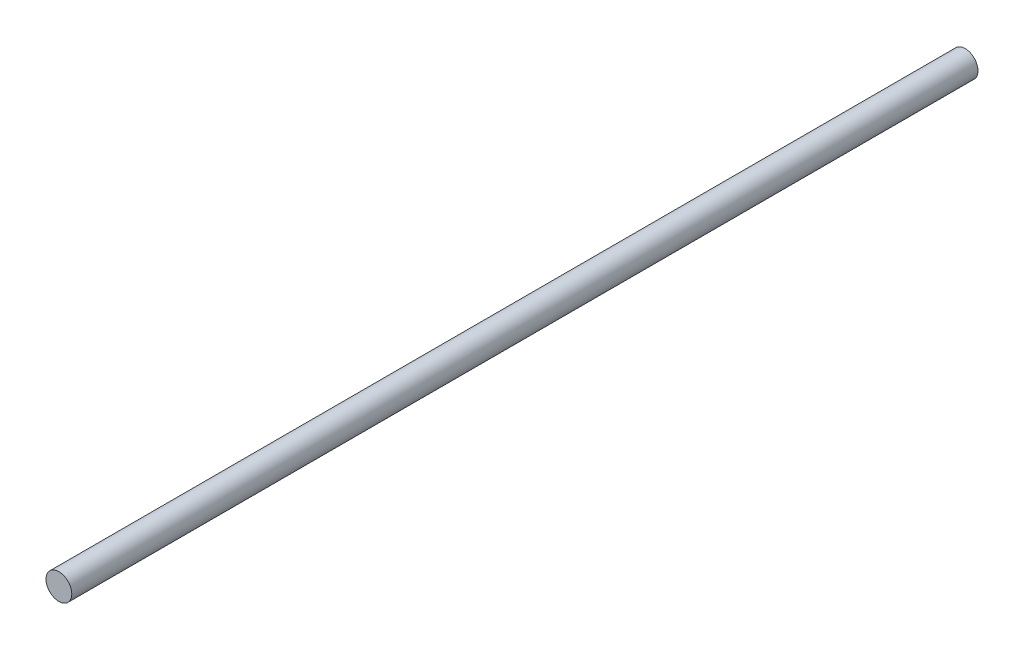
ISO-10303-21;
HEADER;
FILE_DESCRIPTION(('STEP AP214'),'2;1');
FILE_NAME('part.step','',(''),(''),'','','');
FILE_SCHEMA(('AUTOMOTIVE_DESIGN { 1 0 10303 214 1 1 1 1 }'));
ENDSEC;
DATA;
#1=APPLICATION_CONTEXT('core data for automotive mechanical design processes');
#2=APPLICATION_PROTOCOL_DEFINITION('international standard','automotive_design',2000,#1);
#3=PRODUCT_CONTEXT('',#1,'mechanical');
#4=PRODUCT('Part','Part','',(#3));
#5=PRODUCT_RELATED_PRODUCT_CATEGORY('part','',(#4));
#6=PRODUCT_DEFINITION_FORMATION('','',#4);
#7=PRODUCT_DEFINITION_CONTEXT('part definition',#1,'design');
#8=PRODUCT_DEFINITION('design','',#6,#7);
#9=PRODUCT_DEFINITION_SHAPE('','',#8);
#10=(LENGTH_UNIT() NAMED_UNIT(*) SI_UNIT(.MILLI.,.METRE.));
#11=(NAMED_UNIT(*) PLANE_ANGLE_UNIT() SI_UNIT($,.RADIAN.));
#12=(NAMED_UNIT(*) SI_UNIT($,.STERADIAN.) SOLID_ANGLE_UNIT());
#13=UNCERTAINTY_MEASURE_WITH_UNIT(LENGTH_MEASURE(1.E-05),#10,'distance_accuracy_value','');
#14=(GEOMETRIC_REPRESENTATION_CONTEXT(3) GLOBAL_UNCERTAINTY_ASSIGNED_CONTEXT((#13)) GLOBAL_UNIT_ASSIGNED_CONTEXT((#10,
#11,#12)) REPRESENTATION_CONTEXT('',''));
#15=CARTESIAN_POINT('',(0.,0.,0.));
#16=DIRECTION('',(0.,0.,1.));
#17=DIRECTION('',(1.,0.,0.));
#18=AXIS2_PLACEMENT_3D('',#15,#16,#17);
#19=CARTESIAN_POINT('',(0.,0.,223.));
#20=DIRECTION('',(0.,0.,-1.));
#21=DIRECTION('',(-1.,0.,0.));
#22=AXIS2_PLACEMENT_3D('',#19,#20,#21);
#23=CYLINDRICAL_SURFACE('',#22,3.175);
#24=CARTESIAN_POINT('',(0.,0.,223.));
#25=DIRECTION('',(0.,0.,1.));
#26=DIRECTION('',(1.,0.,0.));
#27=AXIS2_PLACEMENT_3D('',#24,#25,#26);
#28=CIRCLE('',#27,3.175);
#29=CARTESIAN_POINT('',(3.175,0.,223.));
#30=VERTEX_POINT('',#29);
#31=EDGE_CURVE('E10',#30,#30,#28,.T.);
#32=ORIENTED_EDGE('',*,*,#31,.F.);
#33=EDGE_LOOP('',(#32));
#34=FACE_BOUND('',#33,.T.);
#35=CARTESIAN_POINT('',(0.,0.,0.));
#36=DIRECTION('',(0.,0.,1.));
#37=DIRECTION('',(1.,0.,0.));
#38=AXIS2_PLACEMENT_3D('',#35,#36,#37);
#39=CIRCLE('',#38,3.175);
#40=CARTESIAN_POINT('',(3.175,0.,0.));
#41=VERTEX_POINT('',#40);
#42=EDGE_CURVE('E46',#41,#41,#39,.T.);
#43=ORIENTED_EDGE('',*,*,#42,.T.);
#44=EDGE_LOOP('',(#43));
#45=FACE_BOUND('',#44,.T.);
#46=ADVANCED_FACE('F43',(#34,#45),#23,.T.);
#47=CARTESIAN_POINT('',(0.,0.,223.));
#48=DIRECTION('',(0.,0.,1.));
#49=DIRECTION('',(1.,0.,0.));
#50=AXIS2_PLACEMENT_3D('',#47,#48,#49);
#51=PLANE('',#50);
#52=ORIENTED_EDGE('',*,*,#31,.T.);
#53=EDGE_LOOP('',(#52));
#54=FACE_BOUND('',#53,.T.);
#55=ADVANCED_FACE('F60',(#54),#51,.T.);
#56=CARTESIAN_POINT('',(0.,0.,0.));
#57=DIRECTION('',(0.,0.,1.));
#58=DIRECTION('',(1.,0.,0.));
#59=AXIS2_PLACEMENT_3D('',#56,#57,#58);
#60=PLANE('',#59);
#61=ORIENTED_EDGE('',*,*,#42,.F.);
#62=EDGE_LOOP('',(#61));
#63=FACE_BOUND('',#62,.T.);
#64=ADVANCED_FACE('F58',(#63),#60,.F.);
#65=CLOSED_SHELL('',(#46,#55,#64));
#66=MANIFOLD_SOLID_BREP('B2',#65);
#67=ADVANCED_BREP_SHAPE_REPRESENTATION('',(#18,#66),#14);
#68=SHAPE_DEFINITION_REPRESENTATION(#9,#67);
ENDSEC;
END-ISO-10303-21;
